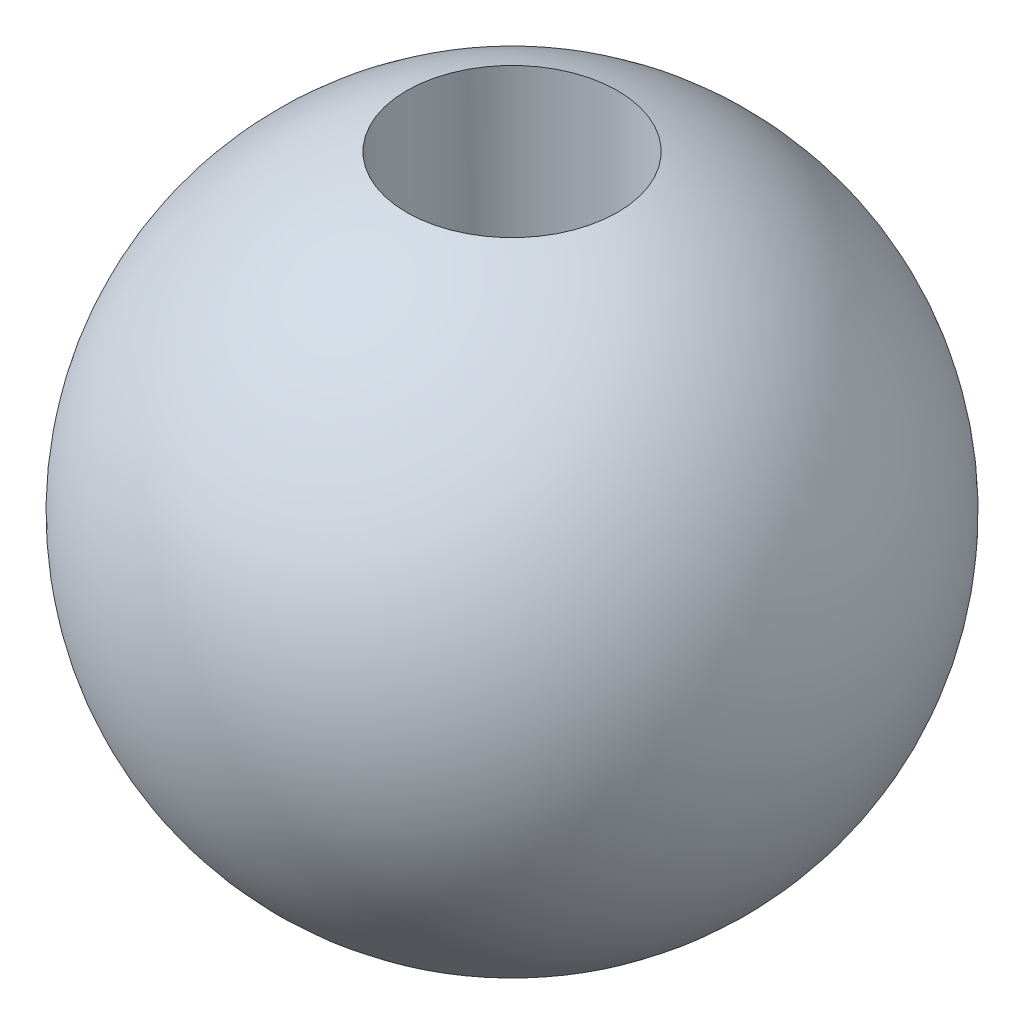
ISO-10303-21;
HEADER;
FILE_DESCRIPTION(('STEP AP214'),'2;1');
FILE_NAME('part.step','',(''),(''),'','','');
FILE_SCHEMA(('AUTOMOTIVE_DESIGN { 1 0 10303 214 1 1 1 1 }'));
ENDSEC;
DATA;
#1=APPLICATION_CONTEXT('core data for automotive mechanical design processes');
#2=APPLICATION_PROTOCOL_DEFINITION('international standard','automotive_design',2000,#1);
#3=PRODUCT_CONTEXT('',#1,'mechanical');
#4=PRODUCT('Part','Part','',(#3));
#5=PRODUCT_RELATED_PRODUCT_CATEGORY('part','',(#4));
#6=PRODUCT_DEFINITION_FORMATION('','',#4);
#7=PRODUCT_DEFINITION_CONTEXT('part definition',#1,'design');
#8=PRODUCT_DEFINITION('design','',#6,#7);
#9=PRODUCT_DEFINITION_SHAPE('','',#8);
#10=(LENGTH_UNIT() NAMED_UNIT(*) SI_UNIT(.MILLI.,.METRE.));
#11=(NAMED_UNIT(*) PLANE_ANGLE_UNIT() SI_UNIT($,.RADIAN.));
#12=(NAMED_UNIT(*) SI_UNIT($,.STERADIAN.) SOLID_ANGLE_UNIT());
#13=UNCERTAINTY_MEASURE_WITH_UNIT(LENGTH_MEASURE(1.E-05),#10,'distance_accuracy_value','');
#14=(GEOMETRIC_REPRESENTATION_CONTEXT(3) GLOBAL_UNCERTAINTY_ASSIGNED_CONTEXT((#13)) GLOBAL_UNIT_ASSIGNED_CONTEXT((#10,
#11,#12)) REPRESENTATION_CONTEXT('',''));
#15=CARTESIAN_POINT('',(0.,0.,0.));
#16=DIRECTION('',(0.,0.,1.));
#17=DIRECTION('',(1.,0.,0.));
#18=AXIS2_PLACEMENT_3D('',#15,#16,#17);
#19=CARTESIAN_POINT('',(0.,-20.,0.));
#20=DIRECTION('',(0.,1.,0.));
#21=DIRECTION('',(0.,0.,1.));
#22=AXIS2_PLACEMENT_3D('',#19,#20,#21);
#23=CYLINDRICAL_SURFACE('',#22,4.);
#24=CARTESIAN_POINT('',(0.,11.842719282327,0.));
#25=DIRECTION('',(0.,-1.,0.));
#26=DIRECTION('',(0.,0.,-1.));
#27=AXIS2_PLACEMENT_3D('',#24,#25,#26);
#28=CIRCLE('',#27,4.);
#29=CARTESIAN_POINT('',(0.,11.842719282327,-4.));
#30=VERTEX_POINT('',#29);
#31=EDGE_CURVE('E40',#30,#30,#28,.F.);
#32=ORIENTED_EDGE('',*,*,#31,.T.);
#33=EDGE_LOOP('',(#32));
#34=FACE_BOUND('',#33,.T.);
#35=CARTESIAN_POINT('',(0.,3.11159214520098,0.));
#36=DIRECTION('',(0.,1.,0.));
#37=DIRECTION('',(0.,0.,1.));
#38=AXIS2_PLACEMENT_3D('',#35,#36,#37);
#39=CIRCLE('',#38,4.);
#40=CARTESIAN_POINT('',(0.,3.11159214520098,4.));
#41=VERTEX_POINT('',#40);
#42=EDGE_CURVE('E10',#41,#41,#39,.T.);
#43=ORIENTED_EDGE('',*,*,#42,.F.);
#44=EDGE_LOOP('',(#43));
#45=FACE_BOUND('',#44,.T.);
#46=ADVANCED_FACE('F32',(#34,#45),#23,.F.);
#47=CARTESIAN_POINT('',(0.,0.,0.));
#48=DIRECTION('',(0.,1.,0.));
#49=DIRECTION('',(1.,0.,0.));
#50=AXIS2_PLACEMENT_3D('',#47,#48,#49);
#51=SPHERICAL_SURFACE('',#50,12.5);
#52=CARTESIAN_POINT('',(0.,-11.3897980666911,0.));
#53=DIRECTION('',(0.,1.,0.));
#54=DIRECTION('',(0.,0.,1.));
#55=AXIS2_PLACEMENT_3D('',#52,#53,#54);
#56=CIRCLE('',#55,5.15);
#57=CARTESIAN_POINT('',(0.,-11.3897980666911,5.15));
#58=VERTEX_POINT('',#57);
#59=EDGE_CURVE('E36',#58,#58,#56,.F.);
#60=ORIENTED_EDGE('',*,*,#59,.F.);
#61=EDGE_LOOP('',(#60));
#62=FACE_BOUND('',#61,.T.);
#63=ORIENTED_EDGE('',*,*,#31,.F.);
#64=EDGE_LOOP('',(#63));
#65=FACE_BOUND('',#64,.T.);
#66=ADVANCED_FACE('F34',(#62,#65),#51,.T.);
#67=CARTESIAN_POINT('',(0.,2.,0.));
#68=DIRECTION('',(0.,1.,0.));
#69=DIRECTION('',(0.,0.,1.));
#70=AXIS2_PLACEMENT_3D('',#67,#68,#69);
#71=CONICAL_SURFACE('',#70,2.15,1.02974425867666);
#72=CARTESIAN_POINT('',(0.,2.,0.));
#73=DIRECTION('',(0.,-1.,0.));
#74=DIRECTION('',(0.,0.,-1.));
#75=AXIS2_PLACEMENT_3D('',#72,#73,#74);
#76=CIRCLE('',#75,2.15);
#77=CARTESIAN_POINT('',(0.,2.,-2.15));
#78=VERTEX_POINT('',#77);
#79=EDGE_CURVE('E44',#78,#78,#76,.T.);
#80=ORIENTED_EDGE('',*,*,#79,.T.);
#81=EDGE_LOOP('',(#80));
#82=FACE_BOUND('',#81,.T.);
#83=ORIENTED_EDGE('',*,*,#42,.T.);
#84=EDGE_LOOP('',(#83));
#85=FACE_BOUND('',#84,.T.);
#86=ADVANCED_FACE('F66',(#82,#85),#71,.F.);
#87=CARTESIAN_POINT('',(0.,0.,0.));
#88=DIRECTION('',(0.,-1.,0.));
#89=DIRECTION('',(0.,0.,-1.));
#90=AXIS2_PLACEMENT_3D('',#87,#88,#89);
#91=CYLINDRICAL_SURFACE('',#90,2.15);
#92=ORIENTED_EDGE('',*,*,#79,.F.);
#93=EDGE_LOOP('',(#92));
#94=FACE_BOUND('',#93,.T.);
#95=CARTESIAN_POINT('',(0.,-2.,0.));
#96=DIRECTION('',(0.,1.,0.));
#97=DIRECTION('',(0.,0.,1.));
#98=AXIS2_PLACEMENT_3D('',#95,#96,#97);
#99=CIRCLE('',#98,2.15);
#100=CARTESIAN_POINT('',(0.,-2.,2.15));
#101=VERTEX_POINT('',#100);
#102=EDGE_CURVE('E49',#101,#101,#99,.F.);
#103=ORIENTED_EDGE('',*,*,#102,.T.);
#104=EDGE_LOOP('',(#103));
#105=FACE_BOUND('',#104,.T.);
#106=ADVANCED_FACE('F61',(#94,#105),#91,.F.);
#107=CARTESIAN_POINT('',(0.,-2.,0.));
#108=DIRECTION('',(0.,1.,0.));
#109=DIRECTION('',(0.,0.,1.));
#110=AXIS2_PLACEMENT_3D('',#107,#108,#109);
#111=PLANE('',#110);
#112=CARTESIAN_POINT('',(0.,-2.,0.));
#113=DIRECTION('',(0.,1.,0.));
#114=DIRECTION('',(0.,0.,1.));
#115=AXIS2_PLACEMENT_3D('',#112,#113,#114);
#116=CIRCLE('',#115,5.15);
#117=CARTESIAN_POINT('',(0.,-2.,5.15));
#118=VERTEX_POINT('',#117);
#119=EDGE_CURVE('E52',#118,#118,#116,.T.);
#120=ORIENTED_EDGE('',*,*,#119,.F.);
#121=EDGE_LOOP('',(#120));
#122=FACE_BOUND('',#121,.T.);
#123=ORIENTED_EDGE('',*,*,#102,.F.);
#124=EDGE_LOOP('',(#123));
#125=FACE_BOUND('',#124,.T.);
#126=ADVANCED_FACE('F58',(#122,#125),#111,.F.);
#127=CARTESIAN_POINT('',(0.,-11.842719282327,0.));
#128=DIRECTION('',(0.,1.,0.));
#129=DIRECTION('',(0.,0.,1.));
#130=AXIS2_PLACEMENT_3D('',#127,#128,#129);
#131=CYLINDRICAL_SURFACE('',#130,5.15);
#132=ORIENTED_EDGE('',*,*,#59,.T.);
#133=EDGE_LOOP('',(#132));
#134=FACE_BOUND('',#133,.T.);
#135=ORIENTED_EDGE('',*,*,#119,.T.);
#136=EDGE_LOOP('',(#135));
#137=FACE_BOUND('',#136,.T.);
#138=ADVANCED_FACE('F56',(#134,#137),#131,.F.);
#139=CLOSED_SHELL('',(#46,#66,#86,#106,#126,#138));
#140=MANIFOLD_SOLID_BREP('B2',#139);
#141=ADVANCED_BREP_SHAPE_REPRESENTATION('',(#18,#140),#14);
#142=SHAPE_DEFINITION_REPRESENTATION(#9,#141);
ENDSEC;
END-ISO-10303-21;
